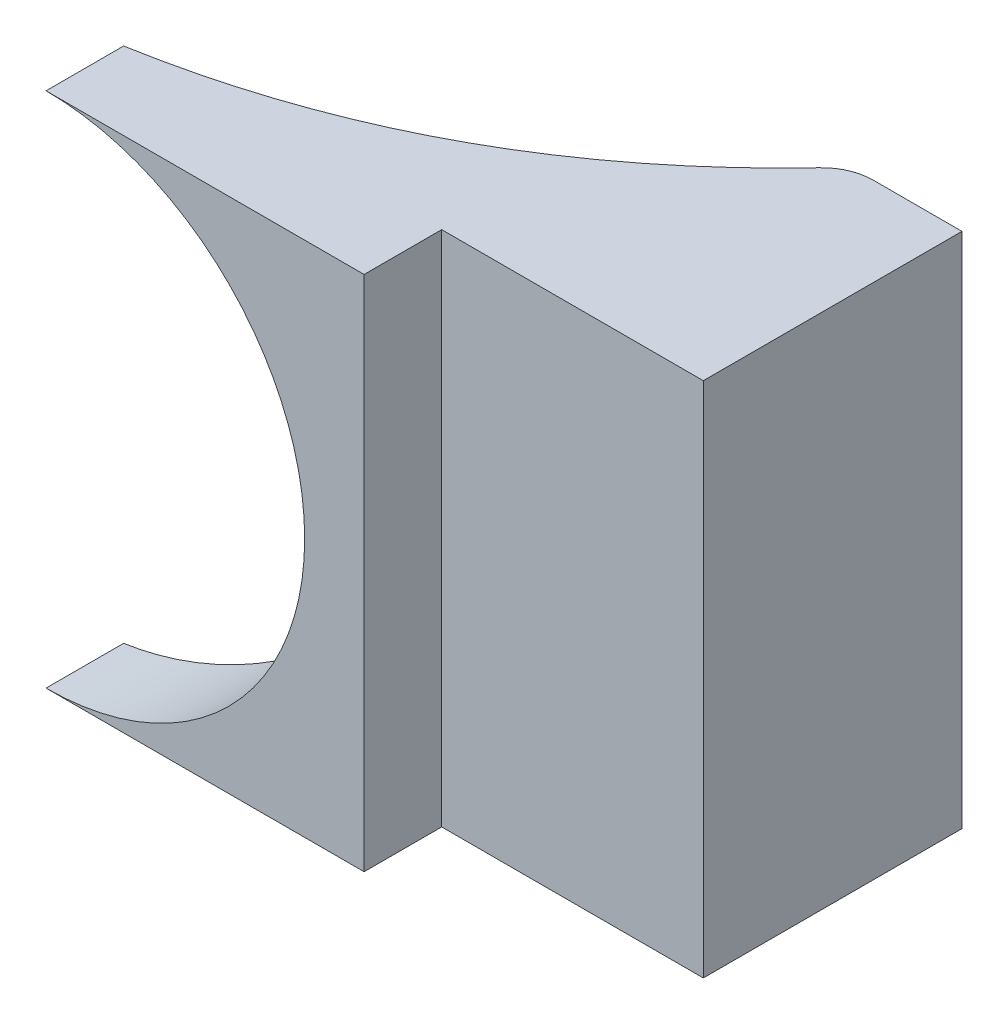
ISO-10303-21;
HEADER;
FILE_DESCRIPTION(('STEP AP214'),'2;1');
FILE_NAME('part.step','',(''),(''),'','','');
FILE_SCHEMA(('AUTOMOTIVE_DESIGN { 1 0 10303 214 1 1 1 1 }'));
ENDSEC;
DATA;
#1=APPLICATION_CONTEXT('core data for automotive mechanical design processes');
#2=APPLICATION_PROTOCOL_DEFINITION('international standard','automotive_design',2000,#1);
#3=PRODUCT_CONTEXT('',#1,'mechanical');
#4=PRODUCT('Part','Part','',(#3));
#5=PRODUCT_RELATED_PRODUCT_CATEGORY('part','',(#4));
#6=PRODUCT_DEFINITION_FORMATION('','',#4);
#7=PRODUCT_DEFINITION_CONTEXT('part definition',#1,'design');
#8=PRODUCT_DEFINITION('design','',#6,#7);
#9=PRODUCT_DEFINITION_SHAPE('','',#8);
#10=(LENGTH_UNIT() NAMED_UNIT(*) SI_UNIT(.MILLI.,.METRE.));
#11=(NAMED_UNIT(*) PLANE_ANGLE_UNIT() SI_UNIT($,.RADIAN.));
#12=(NAMED_UNIT(*) SI_UNIT($,.STERADIAN.) SOLID_ANGLE_UNIT());
#13=UNCERTAINTY_MEASURE_WITH_UNIT(LENGTH_MEASURE(1.E-05),#10,'distance_accuracy_value','');
#14=(GEOMETRIC_REPRESENTATION_CONTEXT(3) GLOBAL_UNCERTAINTY_ASSIGNED_CONTEXT((#13)) GLOBAL_UNIT_ASSIGNED_CONTEXT((#10,
#11,#12)) REPRESENTATION_CONTEXT('',''));
#15=CARTESIAN_POINT('',(0.,0.,0.));
#16=DIRECTION('',(0.,0.,1.));
#17=DIRECTION('',(1.,0.,0.));
#18=AXIS2_PLACEMENT_3D('',#15,#16,#17);
#19=CARTESIAN_POINT('',(0.,0.,50.));
#20=DIRECTION('',(0.,0.,1.));
#21=DIRECTION('',(1.,0.,0.));
#22=AXIS2_PLACEMENT_3D('',#19,#20,#21);
#23=PLANE('',#22);
#24=DIRECTION('',(1.,0.,0.));
#25=VECTOR('',#24,1.);
#26=CARTESIAN_POINT('',(0.,50.,50.));
#27=LINE('',#26,#25);
#28=CARTESIAN_POINT('',(61.4867925258694,50.,50.));
#29=VERTEX_POINT('',#28);
#30=CARTESIAN_POINT('',(112.060798048854,50.,50.));
#31=VERTEX_POINT('',#30);
#32=EDGE_CURVE('E192',#29,#31,#27,.T.);
#33=ORIENTED_EDGE('',*,*,#32,.F.);
#34=DIRECTION('',(0.,1.,0.));
#35=VECTOR('',#34,1.);
#36=CARTESIAN_POINT('',(61.4867925258694,50.,50.));
#37=LINE('',#36,#35);
#38=CARTESIAN_POINT('',(61.4867925258694,-50.,50.));
#39=VERTEX_POINT('',#38);
#40=EDGE_CURVE('E128',#39,#29,#37,.T.);
#41=ORIENTED_EDGE('',*,*,#40,.F.);
#42=DIRECTION('',(-1.,0.,0.));
#43=VECTOR('',#42,1.);
#44=CARTESIAN_POINT('',(0.,-50.,50.));
#45=LINE('',#44,#43);
#46=CARTESIAN_POINT('',(112.060798048854,-50.,50.));
#47=VERTEX_POINT('',#46);
#48=EDGE_CURVE('E202',#47,#39,#45,.T.);
#49=ORIENTED_EDGE('',*,*,#48,.F.);
#50=DIRECTION('',(0.,-1.,0.));
#51=VECTOR('',#50,1.);
#52=CARTESIAN_POINT('',(112.060798048854,0.,50.));
#53=LINE('',#52,#51);
#54=EDGE_CURVE('E195',#31,#47,#53,.T.);
#55=ORIENTED_EDGE('',*,*,#54,.F.);
#56=EDGE_LOOP('',(#33,#41,#49,#55));
#57=FACE_BOUND('',#56,.T.);
#58=ADVANCED_FACE('F45',(#57),#23,.T.);
#59=CARTESIAN_POINT('',(0.,0.,50.));
#60=DIRECTION('',(0.,0.,-1.));
#61=DIRECTION('',(-1.,0.,0.));
#62=AXIS2_PLACEMENT_3D('',#59,#60,#61);
#63=CYLINDRICAL_SURFACE('',#62,50.);
#64=CARTESIAN_POINT('',(0.,50.,50.));
#65=CARTESIAN_POINT('',(0.477230678843148,50.0000001704735,49.9165889727943));
#66=CARTESIAN_POINT('',(0.954096476180071,49.993167021165,49.8312601331415));
#67=CARTESIAN_POINT('',(1.9067392900952,49.9659026959849,49.6568076263843));
#68=CARTESIAN_POINT('',(2.38251631751392,49.9454716560991,49.5676839972382));
#69=CARTESIAN_POINT('',(3.80723658947148,49.863910370819,49.2947664225021));
#70=CARTESIAN_POINT('',(4.75402521995752,49.78251182295,49.1053460951327));
#71=CARTESIAN_POINT('',(6.63831305053879,49.5664420155139,48.7121504654979));
#72=CARTESIAN_POINT('',(7.57581329605625,49.4317768226445,48.5083768001486));
#73=CARTESIAN_POINT('',(9.43592208125846,49.1106042513321,48.0878374492234));
#74=CARTESIAN_POINT('',(10.3585667421597,48.924252950955,47.8711123953797));
#75=CARTESIAN_POINT('',(12.1890454034511,48.5006164952118,47.4250423859322));
#76=CARTESIAN_POINT('',(13.0968784120354,48.2633279439663,47.1956965896885));
#77=CARTESIAN_POINT('',(14.8950392706229,47.7390290295514,46.7254889081878));
#78=CARTESIAN_POINT('',(15.7853668810759,47.452017986488,46.4846268654929));
#79=CARTESIAN_POINT('',(17.5450717464228,46.8299095599777,45.9929025932099));
#80=CARTESIAN_POINT('',(18.4144705902538,46.4948644471877,45.7420514453354));
#81=CARTESIAN_POINT('',(20.1309903426068,45.7778153744871,45.2314931735591));
#82=CARTESIAN_POINT('',(20.97811159284,45.3958121353674,44.9717861856355));
#83=CARTESIAN_POINT('',(22.6479252473609,44.5862355720364,44.4450293405221));
#84=CARTESIAN_POINT('',(23.4706178725311,44.1586626600243,44.1779795497676));
#85=CARTESIAN_POINT('',(25.0901697920422,43.2590123373543,43.6379683803413));
#86=CARTESIAN_POINT('',(25.8870089969058,42.7869013810767,43.3650026669816));
#87=CARTESIAN_POINT('',(27.4523004041233,41.7998474193312,42.8151046063491));
#88=CARTESIAN_POINT('',(28.2207525440545,41.2849043196844,42.5381722503556));
#89=CARTESIAN_POINT('',(29.7274185230185,40.2136200227774,41.9822202422894));
#90=CARTESIAN_POINT('',(30.4656312106541,39.6572772514511,41.7032005112154));
#91=CARTESIAN_POINT('',(32.3182340150714,38.1788221309468,40.9872966768244));
#92=CARTESIAN_POINT('',(33.4095661841571,37.2276153445264,40.550269426999));
#93=CARTESIAN_POINT('',(35.5072141062522,35.2325626461936,39.6839484704465));
#94=CARTESIAN_POINT('',(36.5135268837289,34.188713494577,39.2546550348029));
#95=CARTESIAN_POINT('',(38.4349403052006,32.0134561522219,38.4122691284131));
#96=CARTESIAN_POINT('',(39.3500166157934,30.8820247448538,37.9991809974577));
#97=CARTESIAN_POINT('',(41.0818293817187,28.5378216822452,37.1984933702017));
#98=CARTESIAN_POINT('',(41.8985675044883,27.3250514067417,36.8108934417699));
#99=CARTESIAN_POINT('',(43.4265924449204,24.8248966351677,36.0707506998565));
#100=CARTESIAN_POINT('',(44.1379177797861,23.5375396329936,35.7181950969679));
#101=CARTESIAN_POINT('',(45.1204591844376,21.5566273928614,35.2228734369436));
#102=CARTESIAN_POINT('',(45.4339458134446,20.8878896526298,35.063326629478));
#103=CARTESIAN_POINT('',(46.0319148307308,19.5348308975966,34.7565645387399));
#104=CARTESIAN_POINT('',(46.3164007908021,18.8505118145617,34.6093477372737));
#105=CARTESIAN_POINT('',(46.8552720190323,17.4680700147862,34.3285092008201));
#106=CARTESIAN_POINT('',(47.109682116383,16.7699592474666,34.1948762646001));
#107=CARTESIAN_POINT('',(47.5878056675028,15.3608018303175,33.9421737742873));
#108=CARTESIAN_POINT('',(47.8115230984198,14.6497568700469,33.823102333537));
#109=CARTESIAN_POINT('',(48.2274967326569,13.2161123949508,33.6005274957291));
#110=CARTESIAN_POINT('',(48.4197530982664,12.4935129397492,33.4970240183655));
#111=CARTESIAN_POINT('',(48.7720516663702,11.0384458947984,33.3065232374357));
#112=CARTESIAN_POINT('',(48.9320974344689,10.3059794068841,33.2195241069553));
#113=CARTESIAN_POINT('',(49.247333988976,8.68929769211464,33.0475681151077));
#114=CARTESIAN_POINT('',(49.3955103415787,7.80330764270959,32.9663079984007));
#115=CARTESIAN_POINT('',(49.64408052731,6.02273447063743,32.8296170157952));
#116=CARTESIAN_POINT('',(49.7444771129217,5.12815184599855,32.7741846620221));
#117=CARTESIAN_POINT('',(49.8968700107337,3.33364130837765,32.6899237693319));
#118=CARTESIAN_POINT('',(49.9488678388203,2.43371356369746,32.661094397189));
#119=CARTESIAN_POINT('',(50.0041202110869,0.632257733409901,32.6304577533539));
#120=CARTESIAN_POINT('',(50.0073937909692,-0.269269589590533,32.6286399287279));
#121=CARTESIAN_POINT('',(49.9652212037218,-2.07086953450134,32.6520284143725));
#122=CARTESIAN_POINT('',(49.9197736180296,-2.97094211329127,32.6772355114989));
#123=CARTESIAN_POINT('',(49.7804714917736,-4.76605504393353,32.7542983271635));
#124=CARTESIAN_POINT('',(49.686621126022,-5.66109582305669,32.8061517474151));
#125=CARTESIAN_POINT('',(49.4072116354816,-7.77482048383615,32.9599434050977));
#126=CARTESIAN_POINT('',(49.2005184262113,-8.98994916051089,33.0733405680237));
#127=CARTESIAN_POINT('',(48.6993964763548,-11.3964841224593,33.3460669348133));
#128=CARTESIAN_POINT('',(48.4049740051424,-12.5878920963912,33.5053928564552));
#129=CARTESIAN_POINT('',(47.7314245032878,-14.940146007371,33.8661093334282));
#130=CARTESIAN_POINT('',(47.352285287135,-16.1009875209137,34.0675059398624));
#131=CARTESIAN_POINT('',(46.5129020818383,-18.3856272769762,34.5077614067166));
#132=CARTESIAN_POINT('',(46.0526536938808,-19.5094235064841,34.7466222988691));
#133=CARTESIAN_POINT('',(45.030920719487,-21.7675174317342,35.2690384746853));
#134=CARTESIAN_POINT('',(44.46563383562,-22.899724208657,35.5541900398129));
#135=CARTESIAN_POINT('',(43.2547529908892,-25.1120840786387,36.154075005455));
#136=CARTESIAN_POINT('',(42.6091574743662,-26.1922361627831,36.4688089789818));
#137=CARTESIAN_POINT('',(41.24192820652,-28.2962528078693,37.1218934945361));
#138=CARTESIAN_POINT('',(40.520270050748,-29.3200991419733,37.4602516044641));
#139=CARTESIAN_POINT('',(39.0054454531229,-31.3071271975143,38.1545476587683));
#140=CARTESIAN_POINT('',(38.21227513166,-32.2703056228329,38.5104865564463));
#141=CARTESIAN_POINT('',(36.4636294805828,-34.2393154916437,39.275794601917));
#142=CARTESIAN_POINT('',(35.4999761501863,-35.237337231912,39.6866046266201));
#143=CARTESIAN_POINT('',(33.4947646890096,-37.1486126240873,40.5154030246569));
#144=CARTESIAN_POINT('',(32.453200861916,-38.0618600668833,40.9333919211388));
#145=CARTESIAN_POINT('',(30.2973242995294,-39.7993728592414,41.7697104734871));
#146=CARTESIAN_POINT('',(29.1829673082362,-40.6235832536682,42.1880401810459));
#147=CARTESIAN_POINT('',(26.8879255098218,-42.177714916084,43.0182347094683));
#148=CARTESIAN_POINT('',(25.7072413337147,-42.9076370808812,43.4300995917883));
#149=CARTESIAN_POINT('',(23.6426408065971,-44.0679683615436,44.1218194552327));
#150=CARTESIAN_POINT('',(22.7736782092766,-44.5232938134051,44.4048438414859));
#151=CARTESIAN_POINT('',(21.0082203103371,-45.3830205476912,44.9627601173561));
#152=CARTESIAN_POINT('',(20.1117228671365,-45.7874178565304,45.2376513711201));
#153=CARTESIAN_POINT('',(18.2937422111785,-46.5436183780674,45.7774990607353));
#154=CARTESIAN_POINT('',(17.3722554987722,-46.895414178724,46.0424540925472));
#155=CARTESIAN_POINT('',(15.508541780694,-47.5442658961363,46.560375705387));
#156=CARTESIAN_POINT('',(14.5663478289444,-47.841402834498,46.8133596110768));
#157=CARTESIAN_POINT('',(12.662984166914,-48.3800265826008,47.3062746441432));
#158=CARTESIAN_POINT('',(11.7018171147408,-48.6215211285344,47.5462075825019));
#159=CARTESIAN_POINT('',(9.76394930223992,-49.0474139151022,48.0116985754028));
#160=CARTESIAN_POINT('',(8.78725652064542,-49.2318405455714,48.2372637330528));
#161=CARTESIAN_POINT('',(7.16158030965944,-49.4887400162987,48.5976541161398));
#162=CARTESIAN_POINT('',(6.51615014234614,-49.5778693766053,48.736868794425));
#163=CARTESIAN_POINT('',(5.22103633148083,-49.7309341290834,49.0084861585651));
#164=CARTESIAN_POINT('',(4.57135382277258,-49.794875985119,49.1408905845405));
#165=CARTESIAN_POINT('',(3.2694174951869,-49.8972616481814,49.3985541637346));
#166=CARTESIAN_POINT('',(2.61716786954364,-49.9357370099527,49.5238219830515));
#167=CARTESIAN_POINT('',(1.3101608413092,-49.9871136766832,49.7672730461338));
#168=CARTESIAN_POINT('',(0.655402805788958,-50.0000080337097,49.8854543567168));
#169=CARTESIAN_POINT('',(0.,-50.,50.));
#170=B_SPLINE_CURVE_WITH_KNOTS('',3,(#64,#65,#66,#67,#68,#69,#70,#71,#72,#73,#74,#75,#76,#77,
#78,#79,#80,#81,#82,#83,#84,#85,#86,#87,#88,#89,#90,#91,#92,#93,#94,#95,#96,#97,#98,#99,#100,
#101,#102,#103,#104,#105,#106,#107,#108,#109,#110,#111,#112,#113,#114,#115,#116,#117,#118,#119,
#120,#121,#122,#123,#124,#125,#126,#127,#128,#129,#130,#131,#132,#133,#134,#135,#136,#137,#138,
#139,#140,#141,#142,#143,#144,#145,#146,#147,#148,#149,#150,#151,#152,#153,#154,#155,#156,#157,
#158,#159,#160,#161,#162,#163,#164,#165,#166,#167,#168,#169),.UNSPECIFIED.,.F.,.F.,(4,2,2,2,2,2,
2,2,2,2,2,2,2,2,2,2,2,2,2,2,2,2,2,2,2,2,2,2,2,2,2,2,2,2,2,2,2,2,2,2,2,2,2,2,2,2,2,2,2,2,2,2,4),
(0.,1.45328587582492,2.90655721824953,5.81171272966755,8.71653745945457,11.6126841562023,
14.509023992959,17.4054034367347,20.298654633749,23.1918614259108,26.0850420498707,
28.9804194569831,31.8758032305919,34.7712971465296,39.3023799550035,43.8336212779634,
48.3660678998509,52.8984376580664,57.4291472102544,59.695291840295,61.9611570284532,
64.2251383670662,66.488826061906,68.7525020793243,71.0159273774645,73.7201136626909,
76.4241441470709,79.1280899362785,81.8309793139219,84.5339473908659,87.236682371749,
90.9455537681839,94.6541601820335,98.3633003792255,102.072641797065,105.960250955393,
109.847935432368,113.736871079292,117.626017832142,121.961910948776,126.298121388413,
130.63699309854,134.975823537109,138.0374036001,141.099222390079,144.161472212999,
147.219145583635,150.276393576387,153.332118211827,155.330430971839,157.328230570641,
159.323550100579,161.319411495428),.UNSPECIFIED.);
#171=CARTESIAN_POINT('',(0.,50.,50.));
#172=VERTEX_POINT('',#171);
#173=CARTESIAN_POINT('',(0.,-50.,50.));
#174=VERTEX_POINT('',#173);
#175=EDGE_CURVE('E133',#172,#174,#170,.T.);
#176=ORIENTED_EDGE('',*,*,#175,.T.);
#177=DIRECTION('',(0.,0.,-1.));
#178=VECTOR('',#177,1.);
#179=CARTESIAN_POINT('',(0.,-50.,65.));
#180=LINE('',#179,#178);
#181=CARTESIAN_POINT('',(0.,-50.,65.));
#182=VERTEX_POINT('',#181);
#183=EDGE_CURVE('E114',#182,#174,#180,.T.);
#184=ORIENTED_EDGE('',*,*,#183,.F.);
#185=CARTESIAN_POINT('',(0.,0.,65.));
#186=DIRECTION('',(0.,0.,-1.));
#187=DIRECTION('',(1.,0.,0.));
#188=AXIS2_PLACEMENT_3D('',#185,#186,#187);
#189=CIRCLE('',#188,50.);
#190=CARTESIAN_POINT('',(0.,50.,65.));
#191=VERTEX_POINT('',#190);
#192=EDGE_CURVE('E121',#191,#182,#189,.T.);
#193=ORIENTED_EDGE('',*,*,#192,.F.);
#194=DIRECTION('',(0.,0.,-1.));
#195=VECTOR('',#194,1.);
#196=CARTESIAN_POINT('',(0.,50.,65.));
#197=LINE('',#196,#195);
#198=EDGE_CURVE('E223',#191,#172,#197,.T.);
#199=ORIENTED_EDGE('',*,*,#198,.T.);
#200=EDGE_LOOP('',(#176,#184,#193,#199));
#201=FACE_BOUND('',#200,.T.);
#202=ADVANCED_FACE('F131',(#201),#63,.F.);
#203=CARTESIAN_POINT('',(0.,-50.,50.));
#204=DIRECTION('',(0.,-1.,0.));
#205=DIRECTION('',(0.,0.,-1.));
#206=AXIS2_PLACEMENT_3D('',#203,#204,#205);
#207=PLANE('',#206);
#208=CARTESIAN_POINT('',(0.,-50.,50.));
#209=CARTESIAN_POINT('',(54.3212141155685,-50.,40.5055226550486));
#210=CARTESIAN_POINT('',(90.4904133380082,-50.,0.));
#211=B_SPLINE_CURVE_WITH_KNOTS('',2,(#208,#209,#210),.UNSPECIFIED.,.F.,.F.,(3,3),(0.,1.),.UNSPECIFIED.);
#212=CARTESIAN_POINT('',(87.60202223891,-50.,3.15442935619903));
#213=VERTEX_POINT('',#212);
#214=EDGE_CURVE('E166',#174,#213,#211,.T.);
#215=ORIENTED_EDGE('',*,*,#214,.T.);
#216=CARTESIAN_POINT('',(94.8916149957607,-50.,10.));
#217=DIRECTION('',(0.,-1.,0.));
#218=DIRECTION('',(0.,0.,-1.));
#219=AXIS2_PLACEMENT_3D('',#216,#217,#218);
#220=CIRCLE('',#219,10.);
#221=CARTESIAN_POINT('',(94.8916149957607,-50.,0.));
#222=VERTEX_POINT('',#221);
#223=EDGE_CURVE('E216',#213,#222,#220,.T.);
#224=ORIENTED_EDGE('',*,*,#223,.T.);
#225=DIRECTION('',(-1.,0.,0.));
#226=VECTOR('',#225,1.);
#227=CARTESIAN_POINT('',(0.,-50.,0.));
#228=LINE('',#227,#226);
#229=CARTESIAN_POINT('',(112.060798048854,-50.,0.));
#230=VERTEX_POINT('',#229);
#231=EDGE_CURVE('E205',#230,#222,#228,.T.);
#232=ORIENTED_EDGE('',*,*,#231,.F.);
#233=DIRECTION('',(0.,0.,-1.));
#234=VECTOR('',#233,1.);
#235=CARTESIAN_POINT('',(112.060798048854,-50.,50.));
#236=LINE('',#235,#234);
#237=EDGE_CURVE('E200',#47,#230,#236,.T.);
#238=ORIENTED_EDGE('',*,*,#237,.F.);
#239=ORIENTED_EDGE('',*,*,#48,.T.);
#240=DIRECTION('',(0.,0.,-1.));
#241=VECTOR('',#240,1.);
#242=CARTESIAN_POINT('',(61.4867925258694,-50.,65.));
#243=LINE('',#242,#241);
#244=CARTESIAN_POINT('',(61.4867925258694,-50.,65.));
#245=VERTEX_POINT('',#244);
#246=EDGE_CURVE('E117',#245,#39,#243,.T.);
#247=ORIENTED_EDGE('',*,*,#246,.F.);
#248=DIRECTION('',(1.,0.,0.));
#249=VECTOR('',#248,1.);
#250=CARTESIAN_POINT('',(61.4867925258694,-50.,65.));
#251=LINE('',#250,#249);
#252=EDGE_CURVE('E109',#182,#245,#251,.T.);
#253=ORIENTED_EDGE('',*,*,#252,.F.);
#254=ORIENTED_EDGE('',*,*,#183,.T.);
#255=EDGE_LOOP('',(#215,#224,#232,#238,#239,#247,#253,#254));
#256=FACE_BOUND('',#255,.T.);
#257=ADVANCED_FACE('F112',(#256),#207,.T.);
#258=CARTESIAN_POINT('',(0.,50.,50.));
#259=DIRECTION('',(0.,1.,0.));
#260=DIRECTION('',(0.,0.,1.));
#261=AXIS2_PLACEMENT_3D('',#258,#259,#260);
#262=PLANE('',#261);
#263=DIRECTION('',(1.,0.,0.));
#264=VECTOR('',#263,1.);
#265=CARTESIAN_POINT('',(0.,50.,0.));
#266=LINE('',#265,#264);
#267=CARTESIAN_POINT('',(94.8916149957607,50.,0.));
#268=VERTEX_POINT('',#267);
#269=CARTESIAN_POINT('',(112.060798048854,50.,0.));
#270=VERTEX_POINT('',#269);
#271=EDGE_CURVE('E210',#268,#270,#266,.T.);
#272=ORIENTED_EDGE('',*,*,#271,.F.);
#273=CARTESIAN_POINT('',(94.8916149957607,50.,10.));
#274=DIRECTION('',(0.,1.,0.));
#275=DIRECTION('',(0.,0.,1.));
#276=AXIS2_PLACEMENT_3D('',#273,#274,#275);
#277=CIRCLE('',#276,10.);
#278=CARTESIAN_POINT('',(87.60202223891,50.,3.15442935619903));
#279=VERTEX_POINT('',#278);
#280=EDGE_CURVE('E11',#268,#279,#277,.T.);
#281=ORIENTED_EDGE('',*,*,#280,.T.);
#282=CARTESIAN_POINT('',(0.,50.,50.));
#283=CARTESIAN_POINT('',(54.3212141155685,50.,40.5055226550486));
#284=CARTESIAN_POINT('',(90.4904133380082,50.,0.));
#285=B_SPLINE_CURVE_WITH_KNOTS('',2,(#282,#283,#284),.UNSPECIFIED.,.F.,.F.,(3,3),(0.,1.),.UNSPECIFIED.);
#286=EDGE_CURVE('E134',#279,#172,#285,.F.);
#287=ORIENTED_EDGE('',*,*,#286,.T.);
#288=ORIENTED_EDGE('',*,*,#198,.F.);
#289=DIRECTION('',(-1.,0.,0.));
#290=VECTOR('',#289,1.);
#291=CARTESIAN_POINT('',(0.,50.,65.));
#292=LINE('',#291,#290);
#293=CARTESIAN_POINT('',(61.4867925258694,50.,65.));
#294=VERTEX_POINT('',#293);
#295=EDGE_CURVE('E125',#294,#191,#292,.T.);
#296=ORIENTED_EDGE('',*,*,#295,.F.);
#297=DIRECTION('',(0.,0.,-1.));
#298=VECTOR('',#297,1.);
#299=CARTESIAN_POINT('',(61.4867925258694,50.,65.));
#300=LINE('',#299,#298);
#301=EDGE_CURVE('E60',#294,#29,#300,.T.);
#302=ORIENTED_EDGE('',*,*,#301,.T.);
#303=ORIENTED_EDGE('',*,*,#32,.T.);
#304=DIRECTION('',(0.,0.,-1.));
#305=VECTOR('',#304,1.);
#306=CARTESIAN_POINT('',(112.060798048854,50.,50.));
#307=LINE('',#306,#305);
#308=EDGE_CURVE('E198',#31,#270,#307,.T.);
#309=ORIENTED_EDGE('',*,*,#308,.T.);
#310=EDGE_LOOP('',(#272,#281,#287,#288,#296,#302,#303,#309));
#311=FACE_BOUND('',#310,.T.);
#312=ADVANCED_FACE('F175',(#311),#262,.T.);
#313=CARTESIAN_POINT('',(0.,0.,0.));
#314=DIRECTION('',(0.,0.,1.));
#315=DIRECTION('',(1.,0.,0.));
#316=AXIS2_PLACEMENT_3D('',#313,#314,#315);
#317=PLANE('',#316);
#318=ORIENTED_EDGE('',*,*,#231,.T.);
#319=DIRECTION('',(0.,1.,0.));
#320=VECTOR('',#319,1.);
#321=CARTESIAN_POINT('',(94.8916149957607,50.,0.));
#322=LINE('',#321,#320);
#323=EDGE_CURVE('E53',#222,#268,#322,.T.);
#324=ORIENTED_EDGE('',*,*,#323,.T.);
#325=ORIENTED_EDGE('',*,*,#271,.T.);
#326=DIRECTION('',(0.,-1.,0.));
#327=VECTOR('',#326,1.);
#328=CARTESIAN_POINT('',(112.060798048854,0.,0.));
#329=LINE('',#328,#327);
#330=EDGE_CURVE('E207',#270,#230,#329,.T.);
#331=ORIENTED_EDGE('',*,*,#330,.T.);
#332=EDGE_LOOP('',(#318,#324,#325,#331));
#333=FACE_BOUND('',#332,.T.);
#334=ADVANCED_FACE('F178',(#333),#317,.F.);
#335=CARTESIAN_POINT('',(112.060798048854,0.,50.));
#336=DIRECTION('',(1.,0.,0.));
#337=DIRECTION('',(0.,1.,0.));
#338=AXIS2_PLACEMENT_3D('',#335,#336,#337);
#339=PLANE('',#338);
#340=ORIENTED_EDGE('',*,*,#330,.F.);
#341=ORIENTED_EDGE('',*,*,#308,.F.);
#342=ORIENTED_EDGE('',*,*,#54,.T.);
#343=ORIENTED_EDGE('',*,*,#237,.T.);
#344=EDGE_LOOP('',(#340,#341,#342,#343));
#345=FACE_BOUND('',#344,.T.);
#346=ADVANCED_FACE('F156',(#345),#339,.T.);
#347=CARTESIAN_POINT('',(0.,122.,50.));
#348=CARTESIAN_POINT('',(54.3212141155685,122.,40.5055226550486));
#349=CARTESIAN_POINT('',(90.4904133380082,122.,0.));
#350=B_SPLINE_CURVE_WITH_KNOTS('',2,(#347,#348,#349),.UNSPECIFIED.,.F.,.F.,(3,3),(0.,1.),.UNSPECIFIED.);
#351=DIRECTION('',(0.,-1.,0.));
#352=VECTOR('',#351,1.);
#353=SURFACE_OF_LINEAR_EXTRUSION('',#350,#352);
#354=ORIENTED_EDGE('',*,*,#286,.F.);
#355=DIRECTION('',(0.,-1.,0.));
#356=VECTOR('',#355,1.);
#357=CARTESIAN_POINT('',(87.6020222389099,50.,3.15442935619911));
#358=LINE('',#357,#356);
#359=EDGE_CURVE('E213',#279,#213,#358,.T.);
#360=ORIENTED_EDGE('',*,*,#359,.T.);
#361=ORIENTED_EDGE('',*,*,#214,.F.);
#362=ORIENTED_EDGE('',*,*,#175,.F.);
#363=EDGE_LOOP('',(#354,#360,#361,#362));
#364=FACE_BOUND('',#363,.T.);
#365=ADVANCED_FACE('F151',(#364),#353,.T.);
#366=CARTESIAN_POINT('',(94.8916149957607,0.,10.));
#367=DIRECTION('',(0.,-1.,0.));
#368=DIRECTION('',(0.,0.,-1.));
#369=AXIS2_PLACEMENT_3D('',#366,#367,#368);
#370=CYLINDRICAL_SURFACE('',#369,10.);
#371=ORIENTED_EDGE('',*,*,#280,.F.);
#372=ORIENTED_EDGE('',*,*,#323,.F.);
#373=ORIENTED_EDGE('',*,*,#223,.F.);
#374=ORIENTED_EDGE('',*,*,#359,.F.);
#375=EDGE_LOOP('',(#371,#372,#373,#374));
#376=FACE_BOUND('',#375,.T.);
#377=ADVANCED_FACE('F47',(#376),#370,.T.);
#378=CARTESIAN_POINT('',(61.4867925258694,50.,65.));
#379=DIRECTION('',(-1.,0.,0.));
#380=DIRECTION('',(0.,0.,1.));
#381=AXIS2_PLACEMENT_3D('',#378,#379,#380);
#382=PLANE('',#381);
#383=ORIENTED_EDGE('',*,*,#40,.T.);
#384=ORIENTED_EDGE('',*,*,#301,.F.);
#385=DIRECTION('',(0.,1.,0.));
#386=VECTOR('',#385,1.);
#387=CARTESIAN_POINT('',(61.4867925258694,50.,65.));
#388=LINE('',#387,#386);
#389=EDGE_CURVE('E120',#245,#294,#388,.T.);
#390=ORIENTED_EDGE('',*,*,#389,.F.);
#391=ORIENTED_EDGE('',*,*,#246,.T.);
#392=EDGE_LOOP('',(#383,#384,#390,#391));
#393=FACE_BOUND('',#392,.T.);
#394=ADVANCED_FACE('F158',(#393),#382,.F.);
#395=CARTESIAN_POINT('',(0.,0.,65.));
#396=DIRECTION('',(0.,0.,1.));
#397=DIRECTION('',(1.,0.,0.));
#398=AXIS2_PLACEMENT_3D('',#395,#396,#397);
#399=PLANE('',#398);
#400=ORIENTED_EDGE('',*,*,#192,.T.);
#401=ORIENTED_EDGE('',*,*,#252,.T.);
#402=ORIENTED_EDGE('',*,*,#389,.T.);
#403=ORIENTED_EDGE('',*,*,#295,.T.);
#404=EDGE_LOOP('',(#400,#401,#402,#403));
#405=FACE_BOUND('',#404,.T.);
#406=ADVANCED_FACE('F124',(#405),#399,.T.);
#407=CLOSED_SHELL('',(#58,#202,#257,#312,#334,#346,#365,#377,#394,#406));
#408=MANIFOLD_SOLID_BREP('B2',#407);
#409=ADVANCED_BREP_SHAPE_REPRESENTATION('',(#18,#408),#14);
#410=SHAPE_DEFINITION_REPRESENTATION(#9,#409);
ENDSEC;
END-ISO-10303-21;
